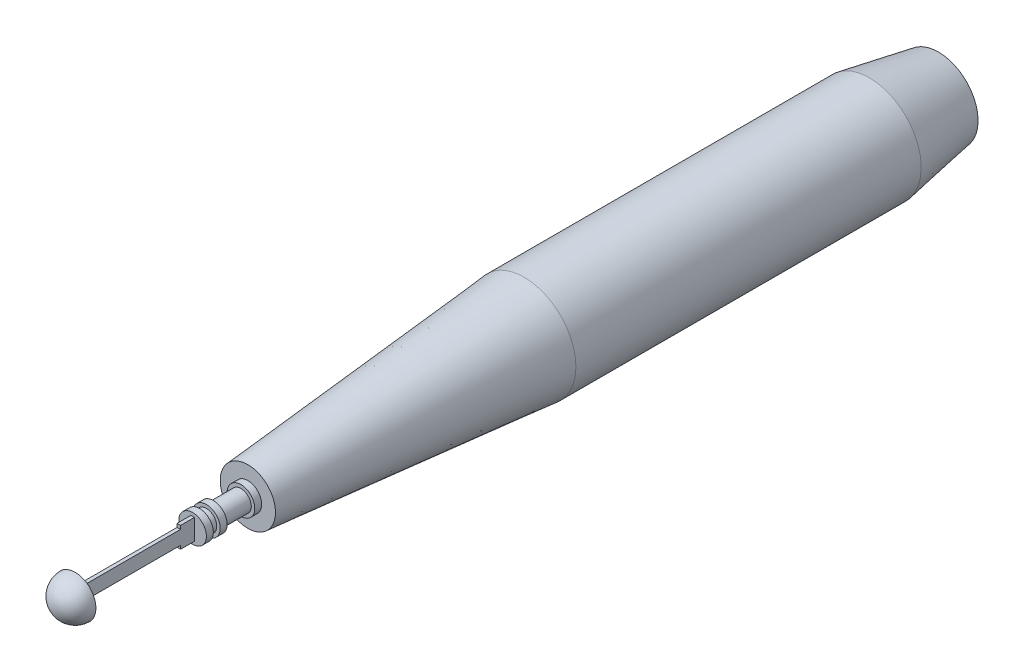
ISO-10303-21;
HEADER;
FILE_DESCRIPTION(('STEP AP214'),'2;1');
FILE_NAME('part.step','',(''),(''),'','','');
FILE_SCHEMA(('AUTOMOTIVE_DESIGN { 1 0 10303 214 1 1 1 1 }'));
ENDSEC;
DATA;
#1=APPLICATION_CONTEXT('core data for automotive mechanical design processes');
#2=APPLICATION_PROTOCOL_DEFINITION('international standard','automotive_design',2000,#1);
#3=PRODUCT_CONTEXT('',#1,'mechanical');
#4=PRODUCT('Part','Part','',(#3));
#5=PRODUCT_RELATED_PRODUCT_CATEGORY('part','',(#4));
#6=PRODUCT_DEFINITION_FORMATION('','',#4);
#7=PRODUCT_DEFINITION_CONTEXT('part definition',#1,'design');
#8=PRODUCT_DEFINITION('design','',#6,#7);
#9=PRODUCT_DEFINITION_SHAPE('','',#8);
#10=(LENGTH_UNIT() NAMED_UNIT(*) SI_UNIT(.MILLI.,.METRE.));
#11=(NAMED_UNIT(*) PLANE_ANGLE_UNIT() SI_UNIT($,.RADIAN.));
#12=(NAMED_UNIT(*) SI_UNIT($,.STERADIAN.) SOLID_ANGLE_UNIT());
#13=UNCERTAINTY_MEASURE_WITH_UNIT(LENGTH_MEASURE(1.E-05),#10,'distance_accuracy_value','');
#14=(GEOMETRIC_REPRESENTATION_CONTEXT(3) GLOBAL_UNCERTAINTY_ASSIGNED_CONTEXT((#13)) GLOBAL_UNIT_ASSIGNED_CONTEXT((#10,
#11,#12)) REPRESENTATION_CONTEXT('',''));
#15=CARTESIAN_POINT('',(0.,0.,0.));
#16=DIRECTION('',(0.,0.,1.));
#17=DIRECTION('',(1.,0.,0.));
#18=AXIS2_PLACEMENT_3D('',#15,#16,#17);
#19=CARTESIAN_POINT('',(0.,0.,113.994798901725));
#20=DIRECTION('',(0.,0.,-1.));
#21=DIRECTION('',(-1.,0.,0.));
#22=AXIS2_PLACEMENT_3D('',#19,#20,#21);
#23=PLANE('',#22);
#24=DIRECTION('',(1.,0.,0.));
#25=VECTOR('',#24,1.);
#26=CARTESIAN_POINT('',(-0.4,-1.6,113.994798901725));
#27=LINE('',#26,#25);
#28=CARTESIAN_POINT('',(-0.4,-1.6,113.994798901725));
#29=VERTEX_POINT('',#28);
#30=CARTESIAN_POINT('',(0.4,-1.6,113.994798901725));
#31=VERTEX_POINT('',#30);
#32=EDGE_CURVE('E64',#29,#31,#27,.T.);
#33=ORIENTED_EDGE('',*,*,#32,.F.);
#34=DIRECTION('',(0.,-1.,0.));
#35=VECTOR('',#34,1.);
#36=CARTESIAN_POINT('',(-0.4,-2.4,113.994798901725));
#37=LINE('',#36,#35);
#38=CARTESIAN_POINT('',(-0.4,-2.4,113.994798901725));
#39=VERTEX_POINT('',#38);
#40=EDGE_CURVE('E168',#29,#39,#37,.T.);
#41=ORIENTED_EDGE('',*,*,#40,.T.);
#42=DIRECTION('',(1.,0.,0.));
#43=VECTOR('',#42,1.);
#44=CARTESIAN_POINT('',(-0.4,-2.4,113.994798901725));
#45=LINE('',#44,#43);
#46=CARTESIAN_POINT('',(0.4,-2.4,113.994798901725));
#47=VERTEX_POINT('',#46);
#48=EDGE_CURVE('E172',#39,#47,#45,.T.);
#49=ORIENTED_EDGE('',*,*,#48,.T.);
#50=DIRECTION('',(0.,1.,0.));
#51=VECTOR('',#50,1.);
#52=CARTESIAN_POINT('',(0.4,-2.4,113.994798901725));
#53=LINE('',#52,#51);
#54=EDGE_CURVE('E161',#47,#31,#53,.T.);
#55=ORIENTED_EDGE('',*,*,#54,.T.);
#56=EDGE_LOOP('',(#33,#41,#49,#55));
#57=FACE_BOUND('',#56,.T.);
#58=ADVANCED_FACE('F46',(#57),#23,.F.);
#59=DIRECTION('',(-1.,0.,0.));
#60=VECTOR('',#59,1.);
#61=CARTESIAN_POINT('',(-0.4,1.6,113.994798901725));
#62=LINE('',#61,#60);
#63=CARTESIAN_POINT('',(0.4,1.6,113.994798901725));
#64=VERTEX_POINT('',#63);
#65=CARTESIAN_POINT('',(-0.4,1.6,113.994798901725));
#66=VERTEX_POINT('',#65);
#67=EDGE_CURVE('E72',#64,#66,#62,.T.);
#68=ORIENTED_EDGE('',*,*,#67,.F.);
#69=CARTESIAN_POINT('',(0.4,2.4,113.994798901725));
#70=VERTEX_POINT('',#69);
#71=EDGE_CURVE('E165',#64,#70,#53,.T.);
#72=ORIENTED_EDGE('',*,*,#71,.T.);
#73=DIRECTION('',(-1.,0.,0.));
#74=VECTOR('',#73,1.);
#75=CARTESIAN_POINT('',(-0.4,2.4,113.994798901725));
#76=LINE('',#75,#74);
#77=CARTESIAN_POINT('',(-0.4,2.4,113.994798901725));
#78=VERTEX_POINT('',#77);
#79=EDGE_CURVE('E164',#70,#78,#76,.T.);
#80=ORIENTED_EDGE('',*,*,#79,.T.);
#81=EDGE_CURVE('E169',#78,#66,#37,.T.);
#82=ORIENTED_EDGE('',*,*,#81,.T.);
#83=EDGE_LOOP('',(#68,#72,#80,#82));
#84=FACE_BOUND('',#83,.T.);
#85=ADVANCED_FACE('F269',(#84),#23,.F.);
#86=CARTESIAN_POINT('',(0.,0.,110.794798901725));
#87=DIRECTION('',(0.,0.,1.));
#88=DIRECTION('',(1.,0.,0.));
#89=AXIS2_PLACEMENT_3D('',#86,#87,#88);
#90=PLANE('',#89);
#91=CARTESIAN_POINT('',(0.,0.,110.794798901725));
#92=DIRECTION('',(0.,0.,1.));
#93=DIRECTION('',(1.,0.,0.));
#94=AXIS2_PLACEMENT_3D('',#91,#92,#93);
#95=CIRCLE('',#94,3.2);
#96=CARTESIAN_POINT('',(3.2,0.,110.794798901725));
#97=VERTEX_POINT('',#96);
#98=EDGE_CURVE('E202',#97,#97,#95,.T.);
#99=ORIENTED_EDGE('',*,*,#98,.T.);
#100=EDGE_LOOP('',(#99));
#101=FACE_BOUND('',#100,.T.);
#102=DIRECTION('',(-1.,0.,0.));
#103=VECTOR('',#102,1.);
#104=CARTESIAN_POINT('',(-0.4,2.4,110.794798901725));
#105=LINE('',#104,#103);
#106=CARTESIAN_POINT('',(0.4,2.4,110.794798901725));
#107=VERTEX_POINT('',#106);
#108=CARTESIAN_POINT('',(-0.4,2.4,110.794798901725));
#109=VERTEX_POINT('',#108);
#110=EDGE_CURVE('E178',#107,#109,#105,.T.);
#111=ORIENTED_EDGE('',*,*,#110,.F.);
#112=DIRECTION('',(0.,1.,0.));
#113=VECTOR('',#112,1.);
#114=CARTESIAN_POINT('',(0.4,-2.4,110.794798901725));
#115=LINE('',#114,#113);
#116=CARTESIAN_POINT('',(0.4,-2.4,110.794798901725));
#117=VERTEX_POINT('',#116);
#118=EDGE_CURVE('E160',#117,#107,#115,.T.);
#119=ORIENTED_EDGE('',*,*,#118,.F.);
#120=DIRECTION('',(1.,0.,0.));
#121=VECTOR('',#120,1.);
#122=CARTESIAN_POINT('',(-0.4,-2.4,110.794798901725));
#123=LINE('',#122,#121);
#124=CARTESIAN_POINT('',(-0.4,-2.4,110.794798901725));
#125=VERTEX_POINT('',#124);
#126=EDGE_CURVE('E185',#125,#117,#123,.T.);
#127=ORIENTED_EDGE('',*,*,#126,.F.);
#128=DIRECTION('',(0.,-1.,0.));
#129=VECTOR('',#128,1.);
#130=CARTESIAN_POINT('',(-0.4,-2.4,110.794798901725));
#131=LINE('',#130,#129);
#132=EDGE_CURVE('E181',#109,#125,#131,.T.);
#133=ORIENTED_EDGE('',*,*,#132,.F.);
#134=EDGE_LOOP('',(#111,#119,#127,#133));
#135=FACE_BOUND('',#134,.T.);
#136=ADVANCED_FACE('F244',(#101,#135),#90,.T.);
#137=CARTESIAN_POINT('',(0.,0.,33.994798901725));
#138=DIRECTION('',(0.,0.,-1.));
#139=DIRECTION('',(-1.,0.,0.));
#140=AXIS2_PLACEMENT_3D('',#137,#138,#139);
#141=CYLINDRICAL_SURFACE('',#140,12.);
#142=CARTESIAN_POINT('',(0.,0.,33.994798901725));
#143=DIRECTION('',(0.,0.,1.));
#144=DIRECTION('',(1.,0.,0.));
#145=AXIS2_PLACEMENT_3D('',#142,#143,#144);
#146=CIRCLE('',#145,12.);
#147=CARTESIAN_POINT('',(12.,0.,33.994798901725));
#148=VERTEX_POINT('',#147);
#149=EDGE_CURVE('E233',#148,#148,#146,.T.);
#150=ORIENTED_EDGE('',*,*,#149,.F.);
#151=EDGE_LOOP('',(#150));
#152=FACE_BOUND('',#151,.T.);
#153=CARTESIAN_POINT('',(0.,0.,-46.005201098275));
#154=DIRECTION('',(0.,0.,-1.));
#155=DIRECTION('',(-1.,0.,0.));
#156=AXIS2_PLACEMENT_3D('',#153,#154,#155);
#157=CIRCLE('',#156,12.);
#158=CARTESIAN_POINT('',(-12.,0.,-46.005201098275));
#159=VERTEX_POINT('',#158);
#160=EDGE_CURVE('E247',#159,#159,#157,.T.);
#161=ORIENTED_EDGE('',*,*,#160,.F.);
#162=EDGE_LOOP('',(#161));
#163=FACE_BOUND('',#162,.T.);
#164=ADVANCED_FACE('F48',(#152,#163),#141,.T.);
#165=CARTESIAN_POINT('',(0.,0.,33.994798901725));
#166=DIRECTION('',(0.,0.,-1.));
#167=DIRECTION('',(1.,0.,0.));
#168=AXIS2_PLACEMENT_3D('',#165,#166,#167);
#169=CONICAL_SURFACE('',#168,12.,0.0872664625997165);
#170=CARTESIAN_POINT('',(0.,0.,97.994798901725));
#171=DIRECTION('',(0.,0.,1.));
#172=DIRECTION('',(1.,0.,0.));
#173=AXIS2_PLACEMENT_3D('',#170,#171,#172);
#174=CIRCLE('',#173,6.40072553434086);
#175=CARTESIAN_POINT('',(6.40072553434086,0.,97.994798901725));
#176=VERTEX_POINT('',#175);
#177=EDGE_CURVE('E229',#176,#176,#174,.T.);
#178=ORIENTED_EDGE('',*,*,#177,.F.);
#179=EDGE_LOOP('',(#178));
#180=FACE_BOUND('',#179,.T.);
#181=ORIENTED_EDGE('',*,*,#149,.T.);
#182=EDGE_LOOP('',(#181));
#183=FACE_BOUND('',#182,.T.);
#184=ADVANCED_FACE('F240',(#180,#183),#169,.T.);
#185=CARTESIAN_POINT('',(0.,0.,97.994798901725));
#186=DIRECTION('',(0.,0.,1.));
#187=DIRECTION('',(1.,0.,0.));
#188=AXIS2_PLACEMENT_3D('',#185,#186,#187);
#189=PLANE('',#188);
#190=CARTESIAN_POINT('',(0.,0.,97.994798901725));
#191=DIRECTION('',(0.,0.,1.));
#192=DIRECTION('',(1.,0.,0.));
#193=AXIS2_PLACEMENT_3D('',#190,#191,#192);
#194=CIRCLE('',#193,3.2);
#195=CARTESIAN_POINT('',(3.2,0.,97.994798901725));
#196=VERTEX_POINT('',#195);
#197=EDGE_CURVE('E56',#196,#196,#194,.T.);
#198=ORIENTED_EDGE('',*,*,#197,.F.);
#199=EDGE_LOOP('',(#198));
#200=FACE_BOUND('',#199,.T.);
#201=ORIENTED_EDGE('',*,*,#177,.T.);
#202=EDGE_LOOP('',(#201));
#203=FACE_BOUND('',#202,.T.);
#204=ADVANCED_FACE('F336',(#200,#203),#189,.T.);
#205=CARTESIAN_POINT('',(0.,0.,99.594798901725));
#206=DIRECTION('',(0.,0.,-1.));
#207=DIRECTION('',(-1.,0.,0.));
#208=AXIS2_PLACEMENT_3D('',#205,#206,#207);
#209=CYLINDRICAL_SURFACE('',#208,3.2);
#210=CARTESIAN_POINT('',(0.,0.,99.594798901725));
#211=DIRECTION('',(0.,0.,1.));
#212=DIRECTION('',(1.,0.,0.));
#213=AXIS2_PLACEMENT_3D('',#210,#211,#212);
#214=CIRCLE('',#213,3.2);
#215=CARTESIAN_POINT('',(3.2,0.,99.594798901725));
#216=VERTEX_POINT('',#215);
#217=EDGE_CURVE('E225',#216,#216,#214,.T.);
#218=ORIENTED_EDGE('',*,*,#217,.F.);
#219=EDGE_LOOP('',(#218));
#220=FACE_BOUND('',#219,.T.);
#221=ORIENTED_EDGE('',*,*,#197,.T.);
#222=EDGE_LOOP('',(#221));
#223=FACE_BOUND('',#222,.T.);
#224=ADVANCED_FACE('F332',(#220,#223),#209,.T.);
#225=CARTESIAN_POINT('',(0.,0.,99.594798901725));
#226=DIRECTION('',(0.,0.,1.));
#227=DIRECTION('',(1.,0.,0.));
#228=AXIS2_PLACEMENT_3D('',#225,#226,#227);
#229=PLANE('',#228);
#230=CARTESIAN_POINT('',(0.,0.,99.594798901725));
#231=DIRECTION('',(0.,0.,1.));
#232=DIRECTION('',(1.,0.,0.));
#233=AXIS2_PLACEMENT_3D('',#230,#231,#232);
#234=CIRCLE('',#233,2.4);
#235=CARTESIAN_POINT('',(2.4,0.,99.594798901725));
#236=VERTEX_POINT('',#235);
#237=EDGE_CURVE('E50',#236,#236,#234,.F.);
#238=ORIENTED_EDGE('',*,*,#237,.T.);
#239=EDGE_LOOP('',(#238));
#240=FACE_BOUND('',#239,.T.);
#241=ORIENTED_EDGE('',*,*,#217,.T.);
#242=EDGE_LOOP('',(#241));
#243=FACE_BOUND('',#242,.T.);
#244=ADVANCED_FACE('F328',(#240,#243),#229,.T.);
#245=CARTESIAN_POINT('',(0.,0.,105.994798901725));
#246=DIRECTION('',(0.,0.,-1.));
#247=DIRECTION('',(-1.,0.,0.));
#248=AXIS2_PLACEMENT_3D('',#245,#246,#247);
#249=CYLINDRICAL_SURFACE('',#248,2.4);
#250=ORIENTED_EDGE('',*,*,#237,.F.);
#251=EDGE_LOOP('',(#250));
#252=FACE_BOUND('',#251,.T.);
#253=CARTESIAN_POINT('',(0.,0.,105.994798901725));
#254=DIRECTION('',(0.,0.,1.));
#255=DIRECTION('',(1.,0.,0.));
#256=AXIS2_PLACEMENT_3D('',#253,#254,#255);
#257=CIRCLE('',#256,2.4);
#258=CARTESIAN_POINT('',(2.4,0.,105.994798901725));
#259=VERTEX_POINT('',#258);
#260=EDGE_CURVE('E218',#259,#259,#257,.T.);
#261=ORIENTED_EDGE('',*,*,#260,.F.);
#262=EDGE_LOOP('',(#261));
#263=FACE_BOUND('',#262,.T.);
#264=ADVANCED_FACE('F324',(#252,#263),#249,.T.);
#265=CARTESIAN_POINT('',(0.,0.,107.594798901725));
#266=DIRECTION('',(0.,0.,-1.));
#267=DIRECTION('',(-1.,0.,0.));
#268=AXIS2_PLACEMENT_3D('',#265,#266,#267);
#269=CYLINDRICAL_SURFACE('',#268,3.2);
#270=CARTESIAN_POINT('',(0.,0.,107.594798901725));
#271=DIRECTION('',(0.,0.,1.));
#272=DIRECTION('',(1.,0.,0.));
#273=AXIS2_PLACEMENT_3D('',#270,#271,#272);
#274=CIRCLE('',#273,3.2);
#275=CARTESIAN_POINT('',(3.2,0.,107.594798901725));
#276=VERTEX_POINT('',#275);
#277=EDGE_CURVE('E214',#276,#276,#274,.T.);
#278=ORIENTED_EDGE('',*,*,#277,.F.);
#279=EDGE_LOOP('',(#278));
#280=FACE_BOUND('',#279,.T.);
#281=CARTESIAN_POINT('',(0.,0.,105.994798901725));
#282=DIRECTION('',(0.,0.,1.));
#283=DIRECTION('',(1.,0.,0.));
#284=AXIS2_PLACEMENT_3D('',#281,#282,#283);
#285=CIRCLE('',#284,3.2);
#286=CARTESIAN_POINT('',(3.2,0.,105.994798901725));
#287=VERTEX_POINT('',#286);
#288=EDGE_CURVE('E212',#287,#287,#285,.T.);
#289=ORIENTED_EDGE('',*,*,#288,.T.);
#290=EDGE_LOOP('',(#289));
#291=FACE_BOUND('',#290,.T.);
#292=ADVANCED_FACE('F317',(#280,#291),#269,.T.);
#293=CARTESIAN_POINT('',(0.,0.,107.594798901725));
#294=DIRECTION('',(0.,0.,1.));
#295=DIRECTION('',(1.,0.,0.));
#296=AXIS2_PLACEMENT_3D('',#293,#294,#295);
#297=PLANE('',#296);
#298=CARTESIAN_POINT('',(0.,0.,107.594798901725));
#299=DIRECTION('',(0.,0.,1.));
#300=DIRECTION('',(1.,0.,0.));
#301=AXIS2_PLACEMENT_3D('',#298,#299,#300);
#302=CIRCLE('',#301,2.4);
#303=CARTESIAN_POINT('',(2.4,0.,107.594798901725));
#304=VERTEX_POINT('',#303);
#305=EDGE_CURVE('E11',#304,#304,#302,.T.);
#306=ORIENTED_EDGE('',*,*,#305,.F.);
#307=EDGE_LOOP('',(#306));
#308=FACE_BOUND('',#307,.T.);
#309=ORIENTED_EDGE('',*,*,#277,.T.);
#310=EDGE_LOOP('',(#309));
#311=FACE_BOUND('',#310,.T.);
#312=ADVANCED_FACE('F314',(#308,#311),#297,.T.);
#313=CARTESIAN_POINT('',(0.,0.,105.994798901725));
#314=DIRECTION('',(0.,0.,1.));
#315=DIRECTION('',(1.,0.,0.));
#316=AXIS2_PLACEMENT_3D('',#313,#314,#315);
#317=PLANE('',#316);
#318=ORIENTED_EDGE('',*,*,#260,.T.);
#319=EDGE_LOOP('',(#318));
#320=FACE_BOUND('',#319,.T.);
#321=ORIENTED_EDGE('',*,*,#288,.F.);
#322=EDGE_LOOP('',(#321));
#323=FACE_BOUND('',#322,.T.);
#324=ADVANCED_FACE('F312',(#320,#323),#317,.F.);
#325=CARTESIAN_POINT('',(0.,0.,109.194798901725));
#326=DIRECTION('',(0.,0.,-1.));
#327=DIRECTION('',(-1.,0.,0.));
#328=AXIS2_PLACEMENT_3D('',#325,#326,#327);
#329=CYLINDRICAL_SURFACE('',#328,2.4);
#330=CARTESIAN_POINT('',(0.,0.,109.194798901725));
#331=DIRECTION('',(0.,0.,1.));
#332=DIRECTION('',(1.,0.,0.));
#333=AXIS2_PLACEMENT_3D('',#330,#331,#332);
#334=CIRCLE('',#333,2.4);
#335=CARTESIAN_POINT('',(2.4,0.,109.194798901725));
#336=VERTEX_POINT('',#335);
#337=EDGE_CURVE('E206',#336,#336,#334,.T.);
#338=ORIENTED_EDGE('',*,*,#337,.F.);
#339=EDGE_LOOP('',(#338));
#340=FACE_BOUND('',#339,.T.);
#341=ORIENTED_EDGE('',*,*,#305,.T.);
#342=EDGE_LOOP('',(#341));
#343=FACE_BOUND('',#342,.T.);
#344=ADVANCED_FACE('F308',(#340,#343),#329,.T.);
#345=CARTESIAN_POINT('',(0.,0.,110.794798901725));
#346=DIRECTION('',(0.,0.,-1.));
#347=DIRECTION('',(-1.,0.,0.));
#348=AXIS2_PLACEMENT_3D('',#345,#346,#347);
#349=CYLINDRICAL_SURFACE('',#348,3.2);
#350=ORIENTED_EDGE('',*,*,#98,.F.);
#351=EDGE_LOOP('',(#350));
#352=FACE_BOUND('',#351,.T.);
#353=CARTESIAN_POINT('',(0.,0.,109.194798901725));
#354=DIRECTION('',(0.,0.,1.));
#355=DIRECTION('',(1.,0.,0.));
#356=AXIS2_PLACEMENT_3D('',#353,#354,#355);
#357=CIRCLE('',#356,3.2);
#358=CARTESIAN_POINT('',(3.2,0.,109.194798901725));
#359=VERTEX_POINT('',#358);
#360=EDGE_CURVE('E201',#359,#359,#357,.T.);
#361=ORIENTED_EDGE('',*,*,#360,.T.);
#362=EDGE_LOOP('',(#361));
#363=FACE_BOUND('',#362,.T.);
#364=ADVANCED_FACE('F304',(#352,#363),#349,.T.);
#365=CARTESIAN_POINT('',(0.,0.,109.194798901725));
#366=DIRECTION('',(0.,0.,1.));
#367=DIRECTION('',(1.,0.,0.));
#368=AXIS2_PLACEMENT_3D('',#365,#366,#367);
#369=PLANE('',#368);
#370=ORIENTED_EDGE('',*,*,#337,.T.);
#371=EDGE_LOOP('',(#370));
#372=FACE_BOUND('',#371,.T.);
#373=ORIENTED_EDGE('',*,*,#360,.F.);
#374=EDGE_LOOP('',(#373));
#375=FACE_BOUND('',#374,.T.);
#376=ADVANCED_FACE('F298',(#372,#375),#369,.F.);
#377=CARTESIAN_POINT('',(0.4,-2.4,113.994798901725));
#378=DIRECTION('',(-1.,0.,0.));
#379=DIRECTION('',(0.,0.,1.));
#380=AXIS2_PLACEMENT_3D('',#377,#378,#379);
#381=PLANE('',#380);
#382=ORIENTED_EDGE('',*,*,#118,.T.);
#383=DIRECTION('',(0.,0.,-1.));
#384=VECTOR('',#383,1.);
#385=CARTESIAN_POINT('',(0.4,2.4,113.994798901725));
#386=LINE('',#385,#384);
#387=EDGE_CURVE('E198',#70,#107,#386,.T.);
#388=ORIENTED_EDGE('',*,*,#387,.F.);
#389=ORIENTED_EDGE('',*,*,#71,.F.);
#390=DIRECTION('',(0.,0.,-1.));
#391=VECTOR('',#390,1.);
#392=CARTESIAN_POINT('',(0.4,1.6,137.994798901725));
#393=LINE('',#392,#391);
#394=CARTESIAN_POINT('',(0.4,1.6,137.994798901725));
#395=VERTEX_POINT('',#394);
#396=EDGE_CURVE('E122',#395,#64,#393,.T.);
#397=ORIENTED_EDGE('',*,*,#396,.F.);
#398=DIRECTION('',(0.,1.,0.));
#399=VECTOR('',#398,1.);
#400=CARTESIAN_POINT('',(0.4,-1.6,137.994798901725));
#401=LINE('',#400,#399);
#402=CARTESIAN_POINT('',(0.4,-1.6,137.994798901725));
#403=VERTEX_POINT('',#402);
#404=EDGE_CURVE('E115',#403,#395,#401,.T.);
#405=ORIENTED_EDGE('',*,*,#404,.F.);
#406=DIRECTION('',(0.,0.,-1.));
#407=VECTOR('',#406,1.);
#408=CARTESIAN_POINT('',(0.4,-1.6,137.994798901725));
#409=LINE('',#408,#407);
#410=EDGE_CURVE('E120',#403,#31,#409,.T.);
#411=ORIENTED_EDGE('',*,*,#410,.T.);
#412=ORIENTED_EDGE('',*,*,#54,.F.);
#413=DIRECTION('',(0.,0.,-1.));
#414=VECTOR('',#413,1.);
#415=CARTESIAN_POINT('',(0.4,-2.4,113.994798901725));
#416=LINE('',#415,#414);
#417=EDGE_CURVE('E175',#47,#117,#416,.T.);
#418=ORIENTED_EDGE('',*,*,#417,.T.);
#419=EDGE_LOOP('',(#382,#388,#389,#397,#405,#411,#412,#418));
#420=FACE_BOUND('',#419,.T.);
#421=ADVANCED_FACE('F118',(#420),#381,.F.);
#422=CARTESIAN_POINT('',(-0.4,2.4,113.994798901725));
#423=DIRECTION('',(0.,-1.,0.));
#424=DIRECTION('',(0.,0.,-1.));
#425=AXIS2_PLACEMENT_3D('',#422,#423,#424);
#426=PLANE('',#425);
#427=ORIENTED_EDGE('',*,*,#110,.T.);
#428=DIRECTION('',(0.,0.,-1.));
#429=VECTOR('',#428,1.);
#430=CARTESIAN_POINT('',(-0.4,2.4,113.994798901725));
#431=LINE('',#430,#429);
#432=EDGE_CURVE('E194',#78,#109,#431,.T.);
#433=ORIENTED_EDGE('',*,*,#432,.F.);
#434=ORIENTED_EDGE('',*,*,#79,.F.);
#435=ORIENTED_EDGE('',*,*,#387,.T.);
#436=EDGE_LOOP('',(#427,#433,#434,#435));
#437=FACE_BOUND('',#436,.T.);
#438=ADVANCED_FACE('F273',(#437),#426,.F.);
#439=CARTESIAN_POINT('',(-0.4,-2.4,113.994798901725));
#440=DIRECTION('',(1.,0.,0.));
#441=DIRECTION('',(0.,0.,-1.));
#442=AXIS2_PLACEMENT_3D('',#439,#440,#441);
#443=PLANE('',#442);
#444=ORIENTED_EDGE('',*,*,#132,.T.);
#445=DIRECTION('',(0.,0.,-1.));
#446=VECTOR('',#445,1.);
#447=CARTESIAN_POINT('',(-0.4,-2.4,113.994798901725));
#448=LINE('',#447,#446);
#449=EDGE_CURVE('E191',#39,#125,#448,.T.);
#450=ORIENTED_EDGE('',*,*,#449,.F.);
#451=ORIENTED_EDGE('',*,*,#40,.F.);
#452=DIRECTION('',(0.,0.,-1.));
#453=VECTOR('',#452,1.);
#454=CARTESIAN_POINT('',(-0.4,-1.6,137.994798901725));
#455=LINE('',#454,#453);
#456=CARTESIAN_POINT('',(-0.4,-1.6,137.994798901725));
#457=VERTEX_POINT('',#456);
#458=EDGE_CURVE('E136',#457,#29,#455,.T.);
#459=ORIENTED_EDGE('',*,*,#458,.F.);
#460=DIRECTION('',(0.,-1.,0.));
#461=VECTOR('',#460,1.);
#462=CARTESIAN_POINT('',(-0.4,-1.6,137.994798901725));
#463=LINE('',#462,#461);
#464=CARTESIAN_POINT('',(-0.4,1.6,137.994798901725));
#465=VERTEX_POINT('',#464);
#466=EDGE_CURVE('E140',#465,#457,#463,.T.);
#467=ORIENTED_EDGE('',*,*,#466,.F.);
#468=DIRECTION('',(0.,0.,-1.));
#469=VECTOR('',#468,1.);
#470=CARTESIAN_POINT('',(-0.4,1.6,137.994798901725));
#471=LINE('',#470,#469);
#472=EDGE_CURVE('E154',#465,#66,#471,.T.);
#473=ORIENTED_EDGE('',*,*,#472,.T.);
#474=ORIENTED_EDGE('',*,*,#81,.F.);
#475=ORIENTED_EDGE('',*,*,#432,.T.);
#476=EDGE_LOOP('',(#444,#450,#451,#459,#467,#473,#474,#475));
#477=FACE_BOUND('',#476,.T.);
#478=ADVANCED_FACE('F263',(#477),#443,.F.);
#479=CARTESIAN_POINT('',(-0.4,-2.4,113.994798901725));
#480=DIRECTION('',(0.,1.,0.));
#481=DIRECTION('',(0.,0.,1.));
#482=AXIS2_PLACEMENT_3D('',#479,#480,#481);
#483=PLANE('',#482);
#484=ORIENTED_EDGE('',*,*,#126,.T.);
#485=ORIENTED_EDGE('',*,*,#417,.F.);
#486=ORIENTED_EDGE('',*,*,#48,.F.);
#487=ORIENTED_EDGE('',*,*,#449,.T.);
#488=EDGE_LOOP('',(#484,#485,#486,#487));
#489=FACE_BOUND('',#488,.T.);
#490=ADVANCED_FACE('F281',(#489),#483,.F.);
#491=CARTESIAN_POINT('',(-0.4,1.6,137.994798901725));
#492=DIRECTION('',(0.,-1.,0.));
#493=DIRECTION('',(0.,0.,-1.));
#494=AXIS2_PLACEMENT_3D('',#491,#492,#493);
#495=PLANE('',#494);
#496=ORIENTED_EDGE('',*,*,#67,.T.);
#497=ORIENTED_EDGE('',*,*,#472,.F.);
#498=DIRECTION('',(-1.,0.,0.));
#499=VECTOR('',#498,1.);
#500=CARTESIAN_POINT('',(-0.4,1.6,137.994798901725));
#501=LINE('',#500,#499);
#502=EDGE_CURVE('E127',#395,#465,#501,.T.);
#503=ORIENTED_EDGE('',*,*,#502,.F.);
#504=ORIENTED_EDGE('',*,*,#396,.T.);
#505=EDGE_LOOP('',(#496,#497,#503,#504));
#506=FACE_BOUND('',#505,.T.);
#507=ADVANCED_FACE('F260',(#506),#495,.F.);
#508=CARTESIAN_POINT('',(-0.4,-1.6,137.994798901725));
#509=DIRECTION('',(0.,1.,0.));
#510=DIRECTION('',(0.,0.,1.));
#511=AXIS2_PLACEMENT_3D('',#508,#509,#510);
#512=PLANE('',#511);
#513=ORIENTED_EDGE('',*,*,#32,.T.);
#514=ORIENTED_EDGE('',*,*,#410,.F.);
#515=DIRECTION('',(1.,0.,0.));
#516=VECTOR('',#515,1.);
#517=CARTESIAN_POINT('',(-0.4,-1.6,137.994798901725));
#518=LINE('',#517,#516);
#519=EDGE_CURVE('E133',#457,#403,#518,.T.);
#520=ORIENTED_EDGE('',*,*,#519,.F.);
#521=ORIENTED_EDGE('',*,*,#458,.T.);
#522=EDGE_LOOP('',(#513,#514,#520,#521));
#523=FACE_BOUND('',#522,.T.);
#524=ADVANCED_FACE('F131',(#523),#512,.F.);
#525=CARTESIAN_POINT('',(0.,0.,137.994798901725));
#526=DIRECTION('',(0.,0.,-1.));
#527=DIRECTION('',(0.,1.,0.));
#528=AXIS2_PLACEMENT_3D('',#525,#526,#527);
#529=PLANE('',#528);
#530=CARTESIAN_POINT('',(0.,0.,137.994798901725));
#531=DIRECTION('',(0.,0.,-1.));
#532=DIRECTION('',(0.,1.,0.));
#533=AXIS2_PLACEMENT_3D('',#530,#531,#532);
#534=CIRCLE('',#533,4.80000000000001);
#535=CARTESIAN_POINT('',(0.,4.80000000000001,137.994798901725));
#536=VERTEX_POINT('',#535);
#537=EDGE_CURVE('E149',#536,#536,#534,.T.);
#538=ORIENTED_EDGE('',*,*,#537,.T.);
#539=EDGE_LOOP('',(#538));
#540=FACE_BOUND('',#539,.T.);
#541=ORIENTED_EDGE('',*,*,#502,.T.);
#542=ORIENTED_EDGE('',*,*,#466,.T.);
#543=ORIENTED_EDGE('',*,*,#519,.T.);
#544=ORIENTED_EDGE('',*,*,#404,.T.);
#545=EDGE_LOOP('',(#541,#542,#543,#544));
#546=FACE_BOUND('',#545,.T.);
#547=ADVANCED_FACE('F138',(#540,#546),#529,.T.);
#548=CARTESIAN_POINT('',(0.,0.,137.994798901725));
#549=DIRECTION('',(0.,0.,-1.));
#550=DIRECTION('',(0.,1.,0.));
#551=AXIS2_PLACEMENT_3D('',#548,#549,#550);
#552=SPHERICAL_SURFACE('',#551,4.8);
#553=ORIENTED_EDGE('',*,*,#537,.F.);
#554=EDGE_LOOP('',(#553));
#555=FACE_BOUND('',#554,.T.);
#556=ADVANCED_FACE('F420',(#555),#552,.T.);
#557=CARTESIAN_POINT('',(0.,0.,-46.005201098275));
#558=DIRECTION('',(0.,0.,1.));
#559=DIRECTION('',(-1.,0.,0.));
#560=AXIS2_PLACEMENT_3D('',#557,#558,#559);
#561=CONICAL_SURFACE('',#560,12.,0.174532925199433);
#562=CARTESIAN_POINT('',(0.,0.,-62.005201098275));
#563=DIRECTION('',(0.,0.,-1.));
#564=DIRECTION('',(-1.,0.,0.));
#565=AXIS2_PLACEMENT_3D('',#562,#563,#564);
#566=CIRCLE('',#565,9.17876830866455);
#567=CARTESIAN_POINT('',(-9.17876830866455,0.,-62.005201098275));
#568=VERTEX_POINT('',#567);
#569=EDGE_CURVE('E250',#568,#568,#566,.T.);
#570=ORIENTED_EDGE('',*,*,#569,.F.);
#571=EDGE_LOOP('',(#570));
#572=FACE_BOUND('',#571,.T.);
#573=ORIENTED_EDGE('',*,*,#160,.T.);
#574=EDGE_LOOP('',(#573));
#575=FACE_BOUND('',#574,.T.);
#576=ADVANCED_FACE('F428',(#572,#575),#561,.T.);
#577=CARTESIAN_POINT('',(0.,0.,-62.005201098275));
#578=DIRECTION('',(0.,0.,-1.));
#579=DIRECTION('',(-1.,0.,0.));
#580=AXIS2_PLACEMENT_3D('',#577,#578,#579);
#581=PLANE('',#580);
#582=ORIENTED_EDGE('',*,*,#569,.T.);
#583=EDGE_LOOP('',(#582));
#584=FACE_BOUND('',#583,.T.);
#585=ADVANCED_FACE('F436',(#584),#581,.T.);
#586=CLOSED_SHELL('',(#58,#85,#136,#164,#184,#204,#224,#244,#264,#292,#312,#324,#344,#364,#376,
#421,#438,#478,#490,#507,#524,#547,#556,#576,#585));
#587=MANIFOLD_SOLID_BREP('B2',#586);
#588=ADVANCED_BREP_SHAPE_REPRESENTATION('',(#18,#587),#14);
#589=SHAPE_DEFINITION_REPRESENTATION(#9,#588);
ENDSEC;
END-ISO-10303-21;
